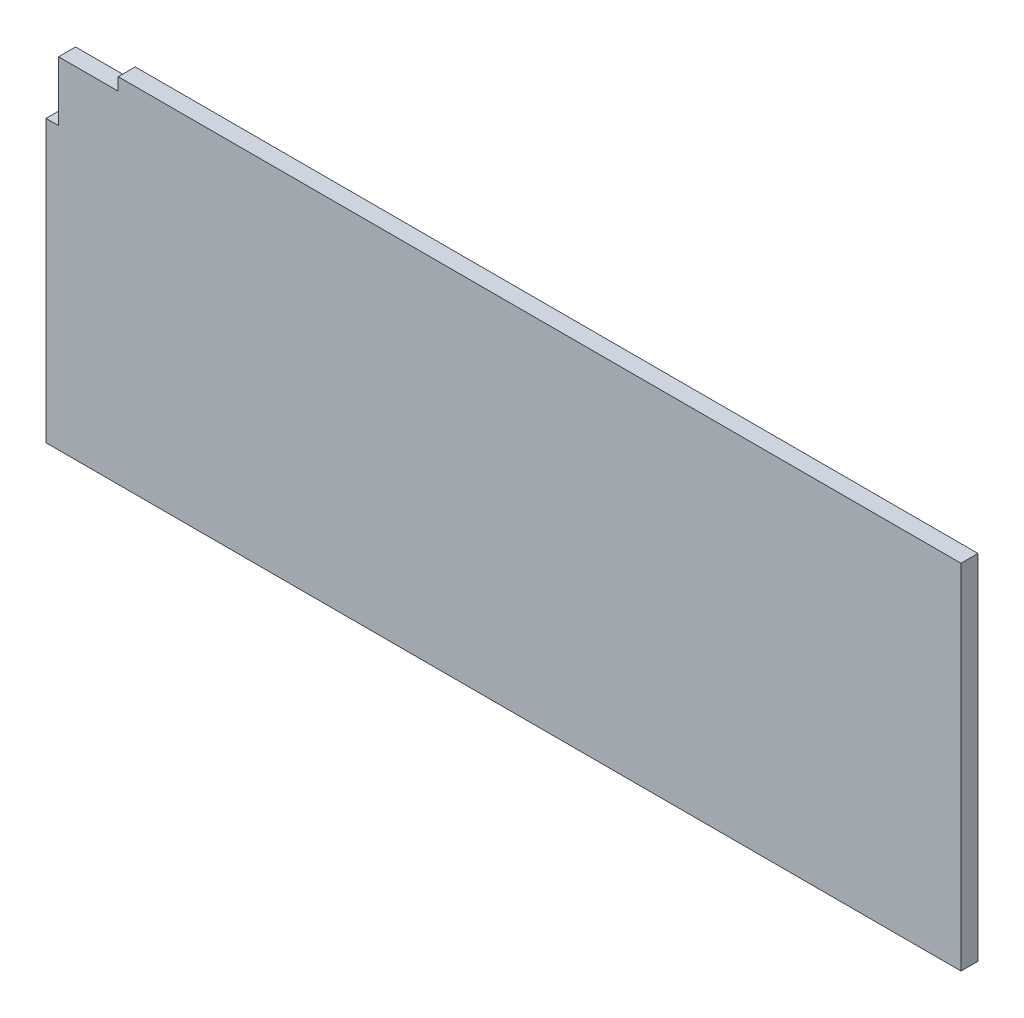
ISO-10303-21;
HEADER;
FILE_DESCRIPTION(('STEP AP214'),'2;1');
FILE_NAME('part.step','',(''),(''),'','','');
FILE_SCHEMA(('AUTOMOTIVE_DESIGN { 1 0 10303 214 1 1 1 1 }'));
ENDSEC;
DATA;
#1=APPLICATION_CONTEXT('core data for automotive mechanical design processes');
#2=APPLICATION_PROTOCOL_DEFINITION('international standard','automotive_design',2000,#1);
#3=PRODUCT_CONTEXT('',#1,'mechanical');
#4=PRODUCT('Part','Part','',(#3));
#5=PRODUCT_RELATED_PRODUCT_CATEGORY('part','',(#4));
#6=PRODUCT_DEFINITION_FORMATION('','',#4);
#7=PRODUCT_DEFINITION_CONTEXT('part definition',#1,'design');
#8=PRODUCT_DEFINITION('design','',#6,#7);
#9=PRODUCT_DEFINITION_SHAPE('','',#8);
#10=(LENGTH_UNIT() NAMED_UNIT(*) SI_UNIT(.MILLI.,.METRE.));
#11=(NAMED_UNIT(*) PLANE_ANGLE_UNIT() SI_UNIT($,.RADIAN.));
#12=(NAMED_UNIT(*) SI_UNIT($,.STERADIAN.) SOLID_ANGLE_UNIT());
#13=UNCERTAINTY_MEASURE_WITH_UNIT(LENGTH_MEASURE(1.E-05),#10,'distance_accuracy_value','');
#14=(GEOMETRIC_REPRESENTATION_CONTEXT(3) GLOBAL_UNCERTAINTY_ASSIGNED_CONTEXT((#13)) GLOBAL_UNIT_ASSIGNED_CONTEXT((#10,
#11,#12)) REPRESENTATION_CONTEXT('',''));
#15=CARTESIAN_POINT('',(0.,0.,0.));
#16=DIRECTION('',(0.,0.,1.));
#17=DIRECTION('',(1.,0.,0.));
#18=AXIS2_PLACEMENT_3D('',#15,#16,#17);
#19=CARTESIAN_POINT('',(0.,0.,6.35));
#20=DIRECTION('',(1.,0.,0.));
#21=DIRECTION('',(0.,0.,-1.));
#22=AXIS2_PLACEMENT_3D('',#19,#20,#21);
#23=PLANE('',#22);
#24=DIRECTION('',(0.,-1.,0.));
#25=VECTOR('',#24,1.);
#26=CARTESIAN_POINT('',(0.,0.,0.));
#27=LINE('',#26,#25);
#28=CARTESIAN_POINT('',(0.,105.,0.));
#29=VERTEX_POINT('',#28);
#30=CARTESIAN_POINT('',(0.,0.,0.));
#31=VERTEX_POINT('',#30);
#32=EDGE_CURVE('E129',#29,#31,#27,.T.);
#33=ORIENTED_EDGE('',*,*,#32,.T.);
#34=DIRECTION('',(0.,0.,-1.));
#35=VECTOR('',#34,1.);
#36=CARTESIAN_POINT('',(0.,0.,6.35));
#37=LINE('',#36,#35);
#38=CARTESIAN_POINT('',(0.,0.,6.35));
#39=VERTEX_POINT('',#38);
#40=EDGE_CURVE('E11',#39,#31,#37,.T.);
#41=ORIENTED_EDGE('',*,*,#40,.F.);
#42=DIRECTION('',(0.,-1.,0.));
#43=VECTOR('',#42,1.);
#44=CARTESIAN_POINT('',(0.,0.,6.35));
#45=LINE('',#44,#43);
#46=CARTESIAN_POINT('',(0.,105.,6.35));
#47=VERTEX_POINT('',#46);
#48=EDGE_CURVE('E143',#47,#39,#45,.T.);
#49=ORIENTED_EDGE('',*,*,#48,.F.);
#50=DIRECTION('',(0.,0.,-1.));
#51=VECTOR('',#50,1.);
#52=CARTESIAN_POINT('',(0.,105.,6.35));
#53=LINE('',#52,#51);
#54=EDGE_CURVE('E125',#47,#29,#53,.T.);
#55=ORIENTED_EDGE('',*,*,#54,.T.);
#56=EDGE_LOOP('',(#33,#41,#49,#55));
#57=FACE_BOUND('',#56,.T.);
#58=ADVANCED_FACE('F33',(#57),#23,.F.);
#59=CARTESIAN_POINT('',(342.,0.,6.35));
#60=DIRECTION('',(0.,1.,0.));
#61=DIRECTION('',(0.,0.,1.));
#62=AXIS2_PLACEMENT_3D('',#59,#60,#61);
#63=PLANE('',#62);
#64=DIRECTION('',(1.,0.,0.));
#65=VECTOR('',#64,1.);
#66=CARTESIAN_POINT('',(342.,0.,0.));
#67=LINE('',#66,#65);
#68=CARTESIAN_POINT('',(342.,0.,0.));
#69=VERTEX_POINT('',#68);
#70=EDGE_CURVE('E132',#31,#69,#67,.T.);
#71=ORIENTED_EDGE('',*,*,#70,.T.);
#72=DIRECTION('',(0.,0.,-1.));
#73=VECTOR('',#72,1.);
#74=CARTESIAN_POINT('',(342.,0.,6.35));
#75=LINE('',#74,#73);
#76=CARTESIAN_POINT('',(342.,0.,6.35));
#77=VERTEX_POINT('',#76);
#78=EDGE_CURVE('E41',#77,#69,#75,.T.);
#79=ORIENTED_EDGE('',*,*,#78,.F.);
#80=DIRECTION('',(1.,0.,0.));
#81=VECTOR('',#80,1.);
#82=CARTESIAN_POINT('',(342.,0.,6.35));
#83=LINE('',#82,#81);
#84=EDGE_CURVE('E92',#39,#77,#83,.T.);
#85=ORIENTED_EDGE('',*,*,#84,.F.);
#86=ORIENTED_EDGE('',*,*,#40,.T.);
#87=EDGE_LOOP('',(#71,#79,#85,#86));
#88=FACE_BOUND('',#87,.T.);
#89=ADVANCED_FACE('F178',(#88),#63,.F.);
#90=CARTESIAN_POINT('',(342.,132.,6.35));
#91=DIRECTION('',(-1.,0.,0.));
#92=DIRECTION('',(0.,0.,1.));
#93=AXIS2_PLACEMENT_3D('',#90,#91,#92);
#94=PLANE('',#93);
#95=DIRECTION('',(0.,1.,0.));
#96=VECTOR('',#95,1.);
#97=CARTESIAN_POINT('',(342.,132.,0.));
#98=LINE('',#97,#96);
#99=CARTESIAN_POINT('',(342.,132.,0.));
#100=VERTEX_POINT('',#99);
#101=EDGE_CURVE('E134',#69,#100,#98,.T.);
#102=ORIENTED_EDGE('',*,*,#101,.T.);
#103=DIRECTION('',(0.,0.,-1.));
#104=VECTOR('',#103,1.);
#105=CARTESIAN_POINT('',(342.,132.,6.35));
#106=LINE('',#105,#104);
#107=CARTESIAN_POINT('',(342.,132.,6.35));
#108=VERTEX_POINT('',#107);
#109=EDGE_CURVE('E150',#108,#100,#106,.T.);
#110=ORIENTED_EDGE('',*,*,#109,.F.);
#111=DIRECTION('',(0.,1.,0.));
#112=VECTOR('',#111,1.);
#113=CARTESIAN_POINT('',(342.,132.,6.35));
#114=LINE('',#113,#112);
#115=EDGE_CURVE('E158',#77,#108,#114,.T.);
#116=ORIENTED_EDGE('',*,*,#115,.F.);
#117=ORIENTED_EDGE('',*,*,#78,.T.);
#118=EDGE_LOOP('',(#102,#110,#116,#117));
#119=FACE_BOUND('',#118,.T.);
#120=ADVANCED_FACE('F156',(#119),#94,.F.);
#121=CARTESIAN_POINT('',(342.,132.,6.35));
#122=DIRECTION('',(0.,-1.,0.));
#123=DIRECTION('',(1.,0.,0.));
#124=AXIS2_PLACEMENT_3D('',#121,#122,#123);
#125=PLANE('',#124);
#126=DIRECTION('',(-1.,0.,0.));
#127=VECTOR('',#126,1.);
#128=CARTESIAN_POINT('',(342.,132.,0.));
#129=LINE('',#128,#127);
#130=CARTESIAN_POINT('',(27.,132.,0.));
#131=VERTEX_POINT('',#130);
#132=EDGE_CURVE('E136',#100,#131,#129,.T.);
#133=ORIENTED_EDGE('',*,*,#132,.T.);
#134=DIRECTION('',(0.,0.,-1.));
#135=VECTOR('',#134,1.);
#136=CARTESIAN_POINT('',(27.,132.,6.35));
#137=LINE('',#136,#135);
#138=CARTESIAN_POINT('',(27.,132.,6.35));
#139=VERTEX_POINT('',#138);
#140=EDGE_CURVE('E147',#139,#131,#137,.T.);
#141=ORIENTED_EDGE('',*,*,#140,.F.);
#142=DIRECTION('',(-1.,0.,0.));
#143=VECTOR('',#142,1.);
#144=CARTESIAN_POINT('',(342.,132.,6.35));
#145=LINE('',#144,#143);
#146=EDGE_CURVE('E170',#108,#139,#145,.T.);
#147=ORIENTED_EDGE('',*,*,#146,.F.);
#148=ORIENTED_EDGE('',*,*,#109,.T.);
#149=EDGE_LOOP('',(#133,#141,#147,#148));
#150=FACE_BOUND('',#149,.T.);
#151=ADVANCED_FACE('F166',(#150),#125,.F.);
#152=CARTESIAN_POINT('',(27.,132.,6.35));
#153=DIRECTION('',(1.,0.,0.));
#154=DIRECTION('',(0.,1.,0.));
#155=AXIS2_PLACEMENT_3D('',#152,#153,#154);
#156=PLANE('',#155);
#157=DIRECTION('',(0.,-1.,0.));
#158=VECTOR('',#157,1.);
#159=CARTESIAN_POINT('',(27.,132.,0.));
#160=LINE('',#159,#158);
#161=CARTESIAN_POINT('',(27.,127.3,0.));
#162=VERTEX_POINT('',#161);
#163=EDGE_CURVE('E138',#131,#162,#160,.T.);
#164=ORIENTED_EDGE('',*,*,#163,.T.);
#165=DIRECTION('',(0.,0.,-1.));
#166=VECTOR('',#165,1.);
#167=CARTESIAN_POINT('',(27.,127.3,6.35));
#168=LINE('',#167,#166);
#169=CARTESIAN_POINT('',(27.,127.3,6.35));
#170=VERTEX_POINT('',#169);
#171=EDGE_CURVE('E120',#170,#162,#168,.T.);
#172=ORIENTED_EDGE('',*,*,#171,.F.);
#173=DIRECTION('',(0.,-1.,0.));
#174=VECTOR('',#173,1.);
#175=CARTESIAN_POINT('',(27.,132.,6.35));
#176=LINE('',#175,#174);
#177=EDGE_CURVE('E111',#139,#170,#176,.T.);
#178=ORIENTED_EDGE('',*,*,#177,.F.);
#179=ORIENTED_EDGE('',*,*,#140,.T.);
#180=EDGE_LOOP('',(#164,#172,#178,#179));
#181=FACE_BOUND('',#180,.T.);
#182=ADVANCED_FACE('F169',(#181),#156,.F.);
#183=CARTESIAN_POINT('',(27.,127.3,6.35));
#184=DIRECTION('',(0.,-1.,0.));
#185=DIRECTION('',(0.,0.,-1.));
#186=AXIS2_PLACEMENT_3D('',#183,#184,#185);
#187=PLANE('',#186);
#188=DIRECTION('',(-1.,0.,0.));
#189=VECTOR('',#188,1.);
#190=CARTESIAN_POINT('',(27.,127.3,0.));
#191=LINE('',#190,#189);
#192=CARTESIAN_POINT('',(4.7,127.3,0.));
#193=VERTEX_POINT('',#192);
#194=EDGE_CURVE('E119',#162,#193,#191,.T.);
#195=ORIENTED_EDGE('',*,*,#194,.T.);
#196=DIRECTION('',(0.,0.,-1.));
#197=VECTOR('',#196,1.);
#198=CARTESIAN_POINT('',(4.7,127.3,6.35));
#199=LINE('',#198,#197);
#200=CARTESIAN_POINT('',(4.7,127.3,6.35));
#201=VERTEX_POINT('',#200);
#202=EDGE_CURVE('E116',#201,#193,#199,.T.);
#203=ORIENTED_EDGE('',*,*,#202,.F.);
#204=DIRECTION('',(-1.,0.,0.));
#205=VECTOR('',#204,1.);
#206=CARTESIAN_POINT('',(27.,127.3,6.35));
#207=LINE('',#206,#205);
#208=EDGE_CURVE('E105',#170,#201,#207,.T.);
#209=ORIENTED_EDGE('',*,*,#208,.F.);
#210=ORIENTED_EDGE('',*,*,#171,.T.);
#211=EDGE_LOOP('',(#195,#203,#209,#210));
#212=FACE_BOUND('',#211,.T.);
#213=ADVANCED_FACE('F117',(#212),#187,.F.);
#214=CARTESIAN_POINT('',(4.7,127.3,6.35));
#215=DIRECTION('',(1.,0.,0.));
#216=DIRECTION('',(0.,1.,0.));
#217=AXIS2_PLACEMENT_3D('',#214,#215,#216);
#218=PLANE('',#217);
#219=DIRECTION('',(0.,-1.,0.));
#220=VECTOR('',#219,1.);
#221=CARTESIAN_POINT('',(4.7,127.3,0.));
#222=LINE('',#221,#220);
#223=CARTESIAN_POINT('',(4.7,105.,0.));
#224=VERTEX_POINT('',#223);
#225=EDGE_CURVE('E78',#193,#224,#222,.T.);
#226=ORIENTED_EDGE('',*,*,#225,.T.);
#227=DIRECTION('',(0.,0.,-1.));
#228=VECTOR('',#227,1.);
#229=CARTESIAN_POINT('',(4.7,105.,6.35));
#230=LINE('',#229,#228);
#231=CARTESIAN_POINT('',(4.7,105.,6.35));
#232=VERTEX_POINT('',#231);
#233=EDGE_CURVE('E121',#232,#224,#230,.T.);
#234=ORIENTED_EDGE('',*,*,#233,.F.);
#235=DIRECTION('',(0.,-1.,0.));
#236=VECTOR('',#235,1.);
#237=CARTESIAN_POINT('',(4.7,127.3,6.35));
#238=LINE('',#237,#236);
#239=EDGE_CURVE('E109',#201,#232,#238,.T.);
#240=ORIENTED_EDGE('',*,*,#239,.F.);
#241=ORIENTED_EDGE('',*,*,#202,.T.);
#242=EDGE_LOOP('',(#226,#234,#240,#241));
#243=FACE_BOUND('',#242,.T.);
#244=ADVANCED_FACE('F123',(#243),#218,.F.);
#245=CARTESIAN_POINT('',(4.7,105.,6.35));
#246=DIRECTION('',(0.,-1.,0.));
#247=DIRECTION('',(0.,0.,-1.));
#248=AXIS2_PLACEMENT_3D('',#245,#246,#247);
#249=PLANE('',#248);
#250=DIRECTION('',(-1.,0.,0.));
#251=VECTOR('',#250,1.);
#252=CARTESIAN_POINT('',(4.7,105.,0.));
#253=LINE('',#252,#251);
#254=EDGE_CURVE('E84',#224,#29,#253,.T.);
#255=ORIENTED_EDGE('',*,*,#254,.T.);
#256=ORIENTED_EDGE('',*,*,#54,.F.);
#257=DIRECTION('',(-1.,0.,0.));
#258=VECTOR('',#257,1.);
#259=CARTESIAN_POINT('',(4.7,105.,6.35));
#260=LINE('',#259,#258);
#261=EDGE_CURVE('E49',#232,#47,#260,.T.);
#262=ORIENTED_EDGE('',*,*,#261,.F.);
#263=ORIENTED_EDGE('',*,*,#233,.T.);
#264=EDGE_LOOP('',(#255,#256,#262,#263));
#265=FACE_BOUND('',#264,.T.);
#266=ADVANCED_FACE('F194',(#265),#249,.F.);
#267=CARTESIAN_POINT('',(0.,0.,6.35));
#268=DIRECTION('',(0.,0.,1.));
#269=DIRECTION('',(1.,0.,0.));
#270=AXIS2_PLACEMENT_3D('',#267,#268,#269);
#271=PLANE('',#270);
#272=ORIENTED_EDGE('',*,*,#48,.T.);
#273=ORIENTED_EDGE('',*,*,#84,.T.);
#274=ORIENTED_EDGE('',*,*,#115,.T.);
#275=ORIENTED_EDGE('',*,*,#146,.T.);
#276=ORIENTED_EDGE('',*,*,#177,.T.);
#277=ORIENTED_EDGE('',*,*,#208,.T.);
#278=ORIENTED_EDGE('',*,*,#239,.T.);
#279=ORIENTED_EDGE('',*,*,#261,.T.);
#280=EDGE_LOOP('',(#272,#273,#274,#275,#276,#277,#278,#279));
#281=FACE_BOUND('',#280,.T.);
#282=ADVANCED_FACE('F107',(#281),#271,.T.);
#283=CARTESIAN_POINT('',(0.,0.,0.));
#284=DIRECTION('',(0.,0.,1.));
#285=DIRECTION('',(1.,0.,0.));
#286=AXIS2_PLACEMENT_3D('',#283,#284,#285);
#287=PLANE('',#286);
#288=ORIENTED_EDGE('',*,*,#32,.F.);
#289=ORIENTED_EDGE('',*,*,#254,.F.);
#290=ORIENTED_EDGE('',*,*,#225,.F.);
#291=ORIENTED_EDGE('',*,*,#194,.F.);
#292=ORIENTED_EDGE('',*,*,#163,.F.);
#293=ORIENTED_EDGE('',*,*,#132,.F.);
#294=ORIENTED_EDGE('',*,*,#101,.F.);
#295=ORIENTED_EDGE('',*,*,#70,.F.);
#296=EDGE_LOOP('',(#288,#289,#290,#291,#292,#293,#294,#295));
#297=FACE_BOUND('',#296,.T.);
#298=ADVANCED_FACE('F162',(#297),#287,.F.);
#299=CLOSED_SHELL('',(#58,#89,#120,#151,#182,#213,#244,#266,#282,#298));
#300=MANIFOLD_SOLID_BREP('B2',#299);
#301=ADVANCED_BREP_SHAPE_REPRESENTATION('',(#18,#300),#14);
#302=SHAPE_DEFINITION_REPRESENTATION(#9,#301);
ENDSEC;
END-ISO-10303-21;
